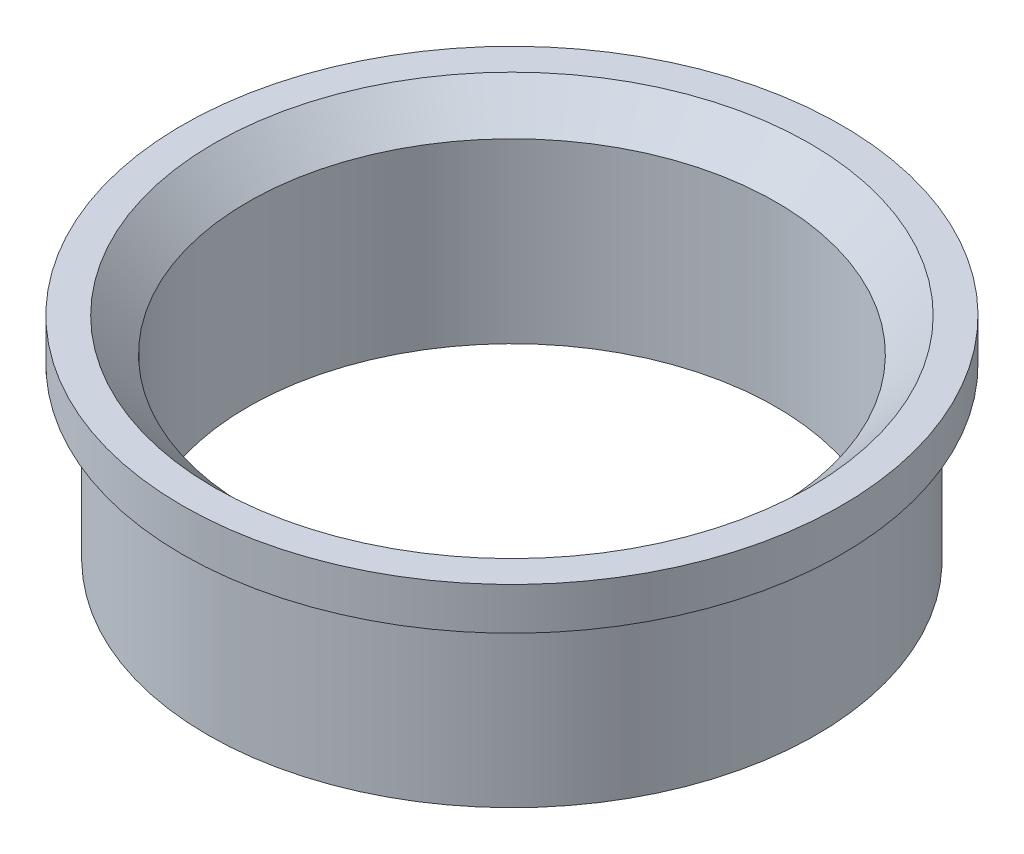
ISO-10303-21;
HEADER;
FILE_DESCRIPTION(('STEP AP214'),'2;1');
FILE_NAME('part.step','',(''),(''),'','','');
FILE_SCHEMA(('AUTOMOTIVE_DESIGN { 1 0 10303 214 1 1 1 1 }'));
ENDSEC;
DATA;
#1=APPLICATION_CONTEXT('core data for automotive mechanical design processes');
#2=APPLICATION_PROTOCOL_DEFINITION('international standard','automotive_design',2000,#1);
#3=PRODUCT_CONTEXT('',#1,'mechanical');
#4=PRODUCT('Part','Part','',(#3));
#5=PRODUCT_RELATED_PRODUCT_CATEGORY('part','',(#4));
#6=PRODUCT_DEFINITION_FORMATION('','',#4);
#7=PRODUCT_DEFINITION_CONTEXT('part definition',#1,'design');
#8=PRODUCT_DEFINITION('design','',#6,#7);
#9=PRODUCT_DEFINITION_SHAPE('','',#8);
#10=(LENGTH_UNIT() NAMED_UNIT(*) SI_UNIT(.MILLI.,.METRE.));
#11=(NAMED_UNIT(*) PLANE_ANGLE_UNIT() SI_UNIT($,.RADIAN.));
#12=(NAMED_UNIT(*) SI_UNIT($,.STERADIAN.) SOLID_ANGLE_UNIT());
#13=UNCERTAINTY_MEASURE_WITH_UNIT(LENGTH_MEASURE(1.E-05),#10,'distance_accuracy_value','');
#14=(GEOMETRIC_REPRESENTATION_CONTEXT(3) GLOBAL_UNCERTAINTY_ASSIGNED_CONTEXT((#13)) GLOBAL_UNIT_ASSIGNED_CONTEXT((#10,
#11,#12)) REPRESENTATION_CONTEXT('',''));
#15=CARTESIAN_POINT('',(0.,0.,0.));
#16=DIRECTION('',(0.,0.,1.));
#17=DIRECTION('',(1.,0.,0.));
#18=AXIS2_PLACEMENT_3D('',#15,#16,#17);
#19=CARTESIAN_POINT('',(0.,0.,-72.));
#20=DIRECTION('',(0.,1.,0.));
#21=DIRECTION('',(0.,0.,1.));
#22=AXIS2_PLACEMENT_3D('',#19,#20,#21);
#23=PLANE('',#22);
#24=CARTESIAN_POINT('',(0.,0.,0.));
#25=DIRECTION('',(0.,1.,0.));
#26=DIRECTION('',(0.,0.,1.));
#27=AXIS2_PLACEMENT_3D('',#24,#25,#26);
#28=CIRCLE('',#27,72.);
#29=CARTESIAN_POINT('',(0.,0.,72.));
#30=VERTEX_POINT('',#29);
#31=EDGE_CURVE('E74',#30,#30,#28,.T.);
#32=ORIENTED_EDGE('',*,*,#31,.F.);
#33=EDGE_LOOP('',(#32));
#34=FACE_BOUND('',#33,.T.);
#35=CARTESIAN_POINT('',(0.,0.,0.));
#36=DIRECTION('',(0.,1.,0.));
#37=DIRECTION('',(0.,0.,1.));
#38=AXIS2_PLACEMENT_3D('',#35,#36,#37);
#39=CIRCLE('',#38,62.5);
#40=CARTESIAN_POINT('',(0.,0.,62.5));
#41=VERTEX_POINT('',#40);
#42=EDGE_CURVE('E10',#41,#41,#39,.T.);
#43=ORIENTED_EDGE('',*,*,#42,.T.);
#44=EDGE_LOOP('',(#43));
#45=FACE_BOUND('',#44,.T.);
#46=ADVANCED_FACE('F43',(#34,#45),#23,.F.);
#47=CARTESIAN_POINT('',(0.,75.2986348122867,0.));
#48=DIRECTION('',(0.,1.,0.));
#49=DIRECTION('',(0.,0.,1.));
#50=AXIS2_PLACEMENT_3D('',#47,#48,#49);
#51=CYLINDRICAL_SURFACE('',#50,62.5);
#52=ORIENTED_EDGE('',*,*,#42,.F.);
#53=EDGE_LOOP('',(#52));
#54=FACE_BOUND('',#53,.T.);
#55=CARTESIAN_POINT('',(0.,42.,0.));
#56=DIRECTION('',(0.,1.,0.));
#57=DIRECTION('',(0.,0.,1.));
#58=AXIS2_PLACEMENT_3D('',#55,#56,#57);
#59=CIRCLE('',#58,62.5);
#60=CARTESIAN_POINT('',(0.,42.,62.5));
#61=VERTEX_POINT('',#60);
#62=EDGE_CURVE('E50',#61,#61,#59,.T.);
#63=ORIENTED_EDGE('',*,*,#62,.T.);
#64=EDGE_LOOP('',(#63));
#65=FACE_BOUND('',#64,.T.);
#66=ADVANCED_FACE('F82',(#54,#65),#51,.F.);
#67=CARTESIAN_POINT('',(0.,50.,0.));
#68=DIRECTION('',(0.,1.,0.));
#69=DIRECTION('',(0.,0.,1.));
#70=AXIS2_PLACEMENT_3D('',#67,#68,#69);
#71=CONICAL_SURFACE('',#70,70.5,0.78539816339745);
#72=ORIENTED_EDGE('',*,*,#62,.F.);
#73=EDGE_LOOP('',(#72));
#74=FACE_BOUND('',#73,.T.);
#75=CARTESIAN_POINT('',(0.,50.,0.));
#76=DIRECTION('',(0.,1.,0.));
#77=DIRECTION('',(0.,0.,1.));
#78=AXIS2_PLACEMENT_3D('',#75,#76,#77);
#79=CIRCLE('',#78,70.5);
#80=CARTESIAN_POINT('',(0.,50.,70.5));
#81=VERTEX_POINT('',#80);
#82=EDGE_CURVE('E55',#81,#81,#79,.T.);
#83=ORIENTED_EDGE('',*,*,#82,.T.);
#84=EDGE_LOOP('',(#83));
#85=FACE_BOUND('',#84,.T.);
#86=ADVANCED_FACE('F86',(#74,#85),#71,.F.);
#87=CARTESIAN_POINT('',(0.,50.,-70.5));
#88=DIRECTION('',(0.,-1.,0.));
#89=DIRECTION('',(0.,0.,-1.));
#90=AXIS2_PLACEMENT_3D('',#87,#88,#89);
#91=PLANE('',#90);
#92=ORIENTED_EDGE('',*,*,#82,.F.);
#93=EDGE_LOOP('',(#92));
#94=FACE_BOUND('',#93,.T.);
#95=CARTESIAN_POINT('',(0.,50.,0.));
#96=DIRECTION('',(0.,1.,0.));
#97=DIRECTION('',(0.,0.,1.));
#98=AXIS2_PLACEMENT_3D('',#95,#96,#97);
#99=CIRCLE('',#98,78.);
#100=CARTESIAN_POINT('',(0.,50.,78.));
#101=VERTEX_POINT('',#100);
#102=EDGE_CURVE('E60',#101,#101,#99,.T.);
#103=ORIENTED_EDGE('',*,*,#102,.T.);
#104=EDGE_LOOP('',(#103));
#105=FACE_BOUND('',#104,.T.);
#106=ADVANCED_FACE('F91',(#94,#105),#91,.F.);
#107=CARTESIAN_POINT('',(0.,75.2986348122867,0.));
#108=DIRECTION('',(0.,1.,0.));
#109=DIRECTION('',(0.,0.,1.));
#110=AXIS2_PLACEMENT_3D('',#107,#108,#109);
#111=CYLINDRICAL_SURFACE('',#110,78.);
#112=ORIENTED_EDGE('',*,*,#102,.F.);
#113=EDGE_LOOP('',(#112));
#114=FACE_BOUND('',#113,.T.);
#115=CARTESIAN_POINT('',(0.,40.,0.));
#116=DIRECTION('',(0.,1.,0.));
#117=DIRECTION('',(0.,0.,1.));
#118=AXIS2_PLACEMENT_3D('',#115,#116,#117);
#119=CIRCLE('',#118,78.);
#120=CARTESIAN_POINT('',(0.,40.,78.));
#121=VERTEX_POINT('',#120);
#122=EDGE_CURVE('E66',#121,#121,#119,.T.);
#123=ORIENTED_EDGE('',*,*,#122,.T.);
#124=EDGE_LOOP('',(#123));
#125=FACE_BOUND('',#124,.T.);
#126=ADVANCED_FACE('F97',(#114,#125),#111,.T.);
#127=CARTESIAN_POINT('',(0.,40.,-78.));
#128=DIRECTION('',(0.,1.,0.));
#129=DIRECTION('',(0.,0.,1.));
#130=AXIS2_PLACEMENT_3D('',#127,#128,#129);
#131=PLANE('',#130);
#132=ORIENTED_EDGE('',*,*,#122,.F.);
#133=EDGE_LOOP('',(#132));
#134=FACE_BOUND('',#133,.T.);
#135=CARTESIAN_POINT('',(0.,40.,0.));
#136=DIRECTION('',(0.,1.,0.));
#137=DIRECTION('',(0.,0.,1.));
#138=AXIS2_PLACEMENT_3D('',#135,#136,#137);
#139=CIRCLE('',#138,72.);
#140=CARTESIAN_POINT('',(0.,40.,72.));
#141=VERTEX_POINT('',#140);
#142=EDGE_CURVE('E70',#141,#141,#139,.T.);
#143=ORIENTED_EDGE('',*,*,#142,.T.);
#144=EDGE_LOOP('',(#143));
#145=FACE_BOUND('',#144,.T.);
#146=ADVANCED_FACE('F101',(#134,#145),#131,.F.);
#147=CARTESIAN_POINT('',(0.,75.2986348122867,0.));
#148=DIRECTION('',(0.,1.,0.));
#149=DIRECTION('',(0.,0.,1.));
#150=AXIS2_PLACEMENT_3D('',#147,#148,#149);
#151=CYLINDRICAL_SURFACE('',#150,72.);
#152=ORIENTED_EDGE('',*,*,#142,.F.);
#153=EDGE_LOOP('',(#152));
#154=FACE_BOUND('',#153,.T.);
#155=ORIENTED_EDGE('',*,*,#31,.T.);
#156=EDGE_LOOP('',(#155));
#157=FACE_BOUND('',#156,.T.);
#158=ADVANCED_FACE('F79',(#154,#157),#151,.T.);
#159=CLOSED_SHELL('',(#46,#66,#86,#106,#126,#146,#158));
#160=MANIFOLD_SOLID_BREP('B2',#159);
#161=ADVANCED_BREP_SHAPE_REPRESENTATION('',(#18,#160),#14);
#162=SHAPE_DEFINITION_REPRESENTATION(#9,#161);
ENDSEC;
END-ISO-10303-21;
